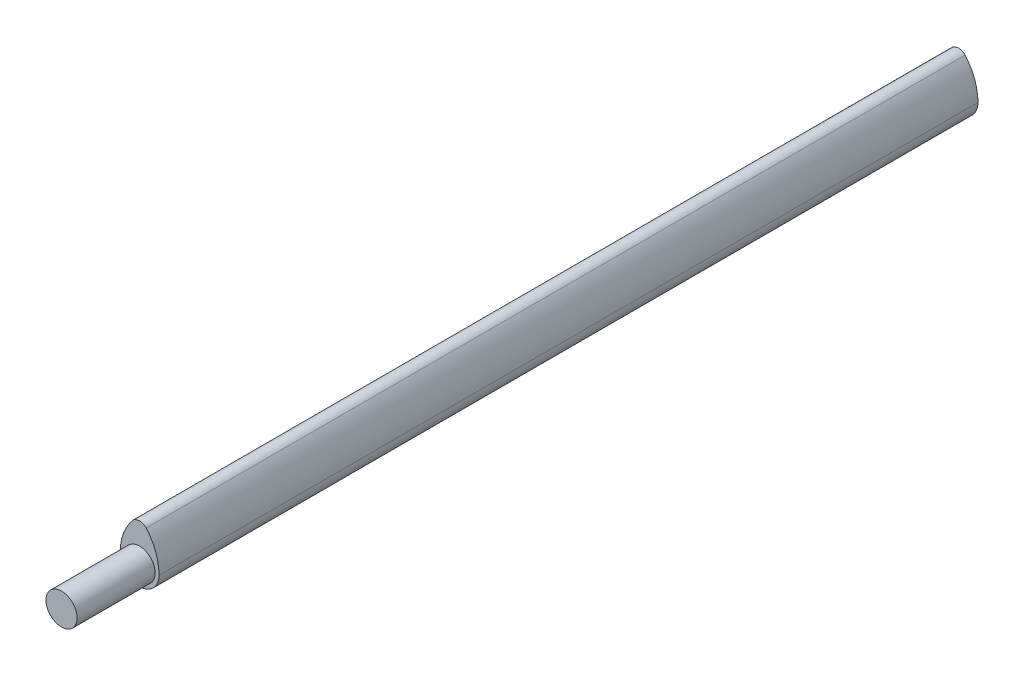
ISO-10303-21;
HEADER;
FILE_DESCRIPTION(('STEP AP214'),'2;1');
FILE_NAME('part.step','',(''),(''),'','','');
FILE_SCHEMA(('AUTOMOTIVE_DESIGN { 1 0 10303 214 1 1 1 1 }'));
ENDSEC;
DATA;
#1=APPLICATION_CONTEXT('core data for automotive mechanical design processes');
#2=APPLICATION_PROTOCOL_DEFINITION('international standard','automotive_design',2000,#1);
#3=PRODUCT_CONTEXT('',#1,'mechanical');
#4=PRODUCT('Part','Part','',(#3));
#5=PRODUCT_RELATED_PRODUCT_CATEGORY('part','',(#4));
#6=PRODUCT_DEFINITION_FORMATION('','',#4);
#7=PRODUCT_DEFINITION_CONTEXT('part definition',#1,'design');
#8=PRODUCT_DEFINITION('design','',#6,#7);
#9=PRODUCT_DEFINITION_SHAPE('','',#8);
#10=(LENGTH_UNIT() NAMED_UNIT(*) SI_UNIT(.MILLI.,.METRE.));
#11=(NAMED_UNIT(*) PLANE_ANGLE_UNIT() SI_UNIT($,.RADIAN.));
#12=(NAMED_UNIT(*) SI_UNIT($,.STERADIAN.) SOLID_ANGLE_UNIT());
#13=UNCERTAINTY_MEASURE_WITH_UNIT(LENGTH_MEASURE(1.E-05),#10,'distance_accuracy_value','');
#14=(GEOMETRIC_REPRESENTATION_CONTEXT(3) GLOBAL_UNCERTAINTY_ASSIGNED_CONTEXT((#13)) GLOBAL_UNIT_ASSIGNED_CONTEXT((#10,
#11,#12)) REPRESENTATION_CONTEXT('',''));
#15=CARTESIAN_POINT('',(0.,0.,0.));
#16=DIRECTION('',(0.,0.,1.));
#17=DIRECTION('',(1.,0.,0.));
#18=AXIS2_PLACEMENT_3D('',#15,#16,#17);
#19=CARTESIAN_POINT('',(0.,0.,-210.));
#20=DIRECTION('',(0.,0.,1.));
#21=DIRECTION('',(1.,0.,0.));
#22=AXIS2_PLACEMENT_3D('',#19,#20,#21);
#23=CYLINDRICAL_SURFACE('',#22,5.);
#24=DIRECTION('',(0.,0.,1.));
#25=VECTOR('',#24,1.);
#26=CARTESIAN_POINT('',(5.,0.,-210.));
#27=LINE('',#26,#25);
#28=CARTESIAN_POINT('',(5.,0.,-210.));
#29=VERTEX_POINT('',#28);
#30=CARTESIAN_POINT('',(5.,0.,0.));
#31=VERTEX_POINT('',#30);
#32=EDGE_CURVE('E81',#29,#31,#27,.T.);
#33=ORIENTED_EDGE('',*,*,#32,.T.);
#34=CARTESIAN_POINT('',(0.,0.,0.));
#35=DIRECTION('',(0.,0.,1.));
#36=DIRECTION('',(1.,0.,0.));
#37=AXIS2_PLACEMENT_3D('',#34,#35,#36);
#38=CIRCLE('',#37,5.);
#39=CARTESIAN_POINT('',(-5.,0.,0.));
#40=VERTEX_POINT('',#39);
#41=EDGE_CURVE('E36',#40,#31,#38,.T.);
#42=ORIENTED_EDGE('',*,*,#41,.F.);
#43=DIRECTION('',(0.,0.,1.));
#44=VECTOR('',#43,1.);
#45=CARTESIAN_POINT('',(-5.,0.,-210.));
#46=LINE('',#45,#44);
#47=CARTESIAN_POINT('',(-5.,0.,-210.));
#48=VERTEX_POINT('',#47);
#49=EDGE_CURVE('E92',#48,#40,#46,.T.);
#50=ORIENTED_EDGE('',*,*,#49,.F.);
#51=CARTESIAN_POINT('',(0.,0.,-210.));
#52=DIRECTION('',(0.,0.,1.));
#53=DIRECTION('',(1.,0.,0.));
#54=AXIS2_PLACEMENT_3D('',#51,#52,#53);
#55=CIRCLE('',#54,5.);
#56=EDGE_CURVE('E41',#48,#29,#55,.T.);
#57=ORIENTED_EDGE('',*,*,#56,.T.);
#58=EDGE_LOOP('',(#33,#42,#50,#57));
#59=FACE_BOUND('',#58,.T.);
#60=ADVANCED_FACE('F33',(#59),#23,.T.);
#61=CARTESIAN_POINT('',(0.,0.,-210.));
#62=DIRECTION('',(0.,0.,1.));
#63=DIRECTION('',(1.,0.,0.));
#64=AXIS2_PLACEMENT_3D('',#61,#62,#63);
#65=PLANE('',#64);
#66=ORIENTED_EDGE('',*,*,#56,.F.);
#67=CARTESIAN_POINT('',(8.61048934457513,0.,-210.));
#68=DIRECTION('',(0.,0.,1.));
#69=DIRECTION('',(-1.,0.,0.));
#70=AXIS2_PLACEMENT_3D('',#67,#68,#69);
#71=CIRCLE('',#70,13.6104893445751);
#72=CARTESIAN_POINT('',(-1.70579093035672,8.87805054546578,-210.));
#73=VERTEX_POINT('',#72);
#74=EDGE_CURVE('E75',#73,#48,#71,.T.);
#75=ORIENTED_EDGE('',*,*,#74,.F.);
#76=CARTESIAN_POINT('',(0.,7.17225961510906,-210.));
#77=DIRECTION('',(0.,0.,1.));
#78=DIRECTION('',(-1.,0.,0.));
#79=AXIS2_PLACEMENT_3D('',#76,#77,#78);
#80=CIRCLE('',#79,2.41235266828349);
#81=CARTESIAN_POINT('',(1.70579093035672,8.87805054546578,-210.));
#82=VERTEX_POINT('',#81);
#83=EDGE_CURVE('E97',#82,#73,#80,.T.);
#84=ORIENTED_EDGE('',*,*,#83,.F.);
#85=CARTESIAN_POINT('',(-8.61048934457513,0.,-210.));
#86=DIRECTION('',(0.,0.,1.));
#87=DIRECTION('',(1.,0.,0.));
#88=AXIS2_PLACEMENT_3D('',#85,#86,#87);
#89=CIRCLE('',#88,13.6104893445751);
#90=EDGE_CURVE('E84',#29,#82,#89,.T.);
#91=ORIENTED_EDGE('',*,*,#90,.F.);
#92=EDGE_LOOP('',(#66,#75,#84,#91));
#93=FACE_BOUND('',#92,.T.);
#94=ADVANCED_FACE('F96',(#93),#65,.F.);
#95=CARTESIAN_POINT('',(0.,0.,0.));
#96=DIRECTION('',(0.,0.,1.));
#97=DIRECTION('',(1.,0.,0.));
#98=AXIS2_PLACEMENT_3D('',#95,#96,#97);
#99=PLANE('',#98);
#100=CARTESIAN_POINT('',(0.,0.,0.));
#101=DIRECTION('',(0.,0.,1.));
#102=DIRECTION('',(1.,0.,0.));
#103=AXIS2_PLACEMENT_3D('',#100,#101,#102);
#104=CIRCLE('',#103,3.99632759395134);
#105=CARTESIAN_POINT('',(3.99632759395134,0.,0.));
#106=VERTEX_POINT('',#105);
#107=EDGE_CURVE('E11',#106,#106,#104,.T.);
#108=ORIENTED_EDGE('',*,*,#107,.F.);
#109=EDGE_LOOP('',(#108));
#110=FACE_BOUND('',#109,.T.);
#111=ORIENTED_EDGE('',*,*,#41,.T.);
#112=CARTESIAN_POINT('',(-8.61048934457513,0.,0.));
#113=DIRECTION('',(0.,0.,1.));
#114=DIRECTION('',(1.,0.,0.));
#115=AXIS2_PLACEMENT_3D('',#112,#113,#114);
#116=CIRCLE('',#115,13.6104893445751);
#117=CARTESIAN_POINT('',(1.70579093035672,8.87805054546578,0.));
#118=VERTEX_POINT('',#117);
#119=EDGE_CURVE('E87',#31,#118,#116,.T.);
#120=ORIENTED_EDGE('',*,*,#119,.T.);
#121=CARTESIAN_POINT('',(0.,7.17225961510906,0.));
#122=DIRECTION('',(0.,0.,1.));
#123=DIRECTION('',(-1.,0.,0.));
#124=AXIS2_PLACEMENT_3D('',#121,#122,#123);
#125=CIRCLE('',#124,2.41235266828349);
#126=CARTESIAN_POINT('',(-1.70579093035672,8.87805054546578,0.));
#127=VERTEX_POINT('',#126);
#128=EDGE_CURVE('E103',#118,#127,#125,.T.);
#129=ORIENTED_EDGE('',*,*,#128,.T.);
#130=CARTESIAN_POINT('',(8.61048934457513,0.,0.));
#131=DIRECTION('',(0.,0.,1.));
#132=DIRECTION('',(-1.,0.,0.));
#133=AXIS2_PLACEMENT_3D('',#130,#131,#132);
#134=CIRCLE('',#133,13.6104893445751);
#135=EDGE_CURVE('E49',#127,#40,#134,.T.);
#136=ORIENTED_EDGE('',*,*,#135,.T.);
#137=EDGE_LOOP('',(#111,#120,#129,#136));
#138=FACE_BOUND('',#137,.T.);
#139=ADVANCED_FACE('F121',(#110,#138),#99,.T.);
#140=CARTESIAN_POINT('',(8.61048934457513,0.,-210.));
#141=DIRECTION('',(0.,0.,1.));
#142=DIRECTION('',(1.,0.,0.));
#143=AXIS2_PLACEMENT_3D('',#140,#141,#142);
#144=CYLINDRICAL_SURFACE('',#143,13.6104893445751);
#145=ORIENTED_EDGE('',*,*,#135,.F.);
#146=DIRECTION('',(0.,0.,1.));
#147=VECTOR('',#146,1.);
#148=CARTESIAN_POINT('',(-1.70579093035672,8.87805054546578,-210.));
#149=LINE('',#148,#147);
#150=EDGE_CURVE('E57',#73,#127,#149,.T.);
#151=ORIENTED_EDGE('',*,*,#150,.F.);
#152=ORIENTED_EDGE('',*,*,#74,.T.);
#153=ORIENTED_EDGE('',*,*,#49,.T.);
#154=EDGE_LOOP('',(#145,#151,#152,#153));
#155=FACE_BOUND('',#154,.T.);
#156=ADVANCED_FACE('F123',(#155),#144,.T.);
#157=CARTESIAN_POINT('',(0.,7.17225961510906,-210.));
#158=DIRECTION('',(0.,0.,1.));
#159=DIRECTION('',(1.,0.,0.));
#160=AXIS2_PLACEMENT_3D('',#157,#158,#159);
#161=CYLINDRICAL_SURFACE('',#160,2.41235266828349);
#162=ORIENTED_EDGE('',*,*,#128,.F.);
#163=DIRECTION('',(0.,0.,1.));
#164=VECTOR('',#163,1.);
#165=CARTESIAN_POINT('',(1.70579093035672,8.87805054546578,-210.));
#166=LINE('',#165,#164);
#167=EDGE_CURVE('E91',#82,#118,#166,.T.);
#168=ORIENTED_EDGE('',*,*,#167,.F.);
#169=ORIENTED_EDGE('',*,*,#83,.T.);
#170=ORIENTED_EDGE('',*,*,#150,.T.);
#171=EDGE_LOOP('',(#162,#168,#169,#170));
#172=FACE_BOUND('',#171,.T.);
#173=ADVANCED_FACE('F124',(#172),#161,.T.);
#174=CARTESIAN_POINT('',(-8.61048934457513,0.,-210.));
#175=DIRECTION('',(0.,0.,1.));
#176=DIRECTION('',(1.,0.,0.));
#177=AXIS2_PLACEMENT_3D('',#174,#175,#176);
#178=CYLINDRICAL_SURFACE('',#177,13.6104893445751);
#179=ORIENTED_EDGE('',*,*,#119,.F.);
#180=ORIENTED_EDGE('',*,*,#32,.F.);
#181=ORIENTED_EDGE('',*,*,#90,.T.);
#182=ORIENTED_EDGE('',*,*,#167,.T.);
#183=EDGE_LOOP('',(#179,#180,#181,#182));
#184=FACE_BOUND('',#183,.T.);
#185=ADVANCED_FACE('F83',(#184),#178,.T.);
#186=CARTESIAN_POINT('',(0.,0.,20.));
#187=DIRECTION('',(0.,0.,-1.));
#188=DIRECTION('',(-1.,0.,0.));
#189=AXIS2_PLACEMENT_3D('',#186,#187,#188);
#190=CYLINDRICAL_SURFACE('',#189,3.99632759395134);
#191=CARTESIAN_POINT('',(0.,0.,20.));
#192=DIRECTION('',(0.,0.,1.));
#193=DIRECTION('',(1.,0.,0.));
#194=AXIS2_PLACEMENT_3D('',#191,#192,#193);
#195=CIRCLE('',#194,3.99632759395134);
#196=CARTESIAN_POINT('',(3.99632759395134,0.,20.));
#197=VERTEX_POINT('',#196);
#198=EDGE_CURVE('E107',#197,#197,#195,.T.);
#199=ORIENTED_EDGE('',*,*,#198,.F.);
#200=EDGE_LOOP('',(#199));
#201=FACE_BOUND('',#200,.T.);
#202=ORIENTED_EDGE('',*,*,#107,.T.);
#203=EDGE_LOOP('',(#202));
#204=FACE_BOUND('',#203,.T.);
#205=ADVANCED_FACE('F115',(#201,#204),#190,.T.);
#206=CARTESIAN_POINT('',(0.,0.,20.));
#207=DIRECTION('',(0.,0.,1.));
#208=DIRECTION('',(1.,0.,0.));
#209=AXIS2_PLACEMENT_3D('',#206,#207,#208);
#210=PLANE('',#209);
#211=ORIENTED_EDGE('',*,*,#198,.T.);
#212=EDGE_LOOP('',(#211));
#213=FACE_BOUND('',#212,.T.);
#214=ADVANCED_FACE('F113',(#213),#210,.T.);
#215=CLOSED_SHELL('',(#60,#94,#139,#156,#173,#185,#205,#214));
#216=MANIFOLD_SOLID_BREP('B2',#215);
#217=ADVANCED_BREP_SHAPE_REPRESENTATION('',(#18,#216),#14);
#218=SHAPE_DEFINITION_REPRESENTATION(#9,#217);
ENDSEC;
END-ISO-10303-21;
